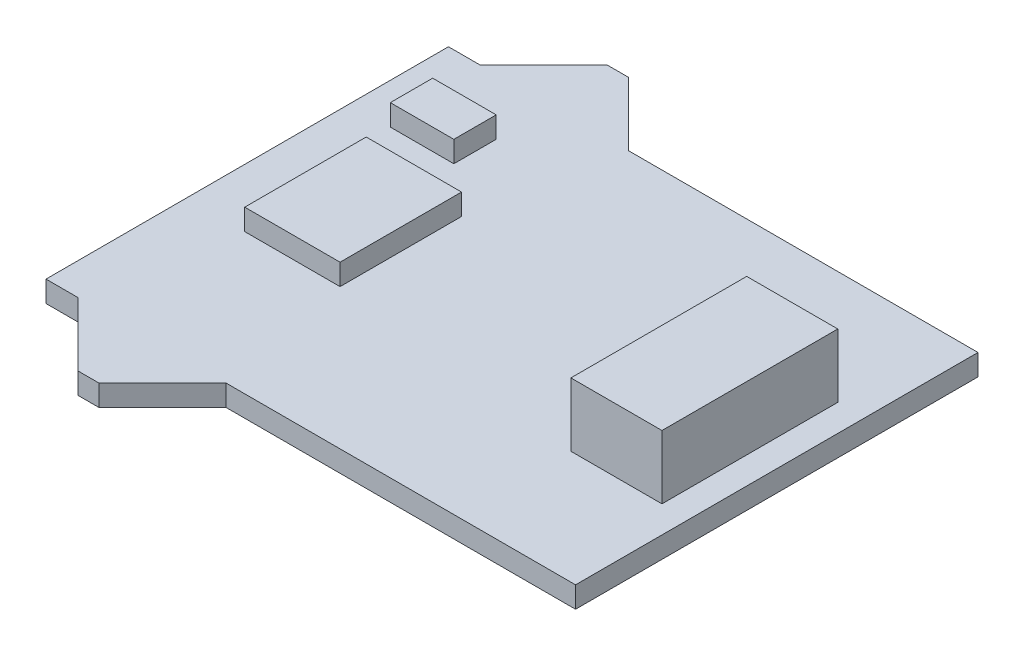
ISO-10303-21;
HEADER;
FILE_DESCRIPTION(('STEP AP214'),'2;1');
FILE_NAME('part.step','',(''),(''),'','','');
FILE_SCHEMA(('AUTOMOTIVE_DESIGN { 1 0 10303 214 1 1 1 1 }'));
ENDSEC;
DATA;
#1=APPLICATION_CONTEXT('core data for automotive mechanical design processes');
#2=APPLICATION_PROTOCOL_DEFINITION('international standard','automotive_design',2000,#1);
#3=PRODUCT_CONTEXT('',#1,'mechanical');
#4=PRODUCT('Part','Part','',(#3));
#5=PRODUCT_RELATED_PRODUCT_CATEGORY('part','',(#4));
#6=PRODUCT_DEFINITION_FORMATION('','',#4);
#7=PRODUCT_DEFINITION_CONTEXT('part definition',#1,'design');
#8=PRODUCT_DEFINITION('design','',#6,#7);
#9=PRODUCT_DEFINITION_SHAPE('','',#8);
#10=(LENGTH_UNIT() NAMED_UNIT(*) SI_UNIT(.MILLI.,.METRE.));
#11=(NAMED_UNIT(*) PLANE_ANGLE_UNIT() SI_UNIT($,.RADIAN.));
#12=(NAMED_UNIT(*) SI_UNIT($,.STERADIAN.) SOLID_ANGLE_UNIT());
#13=UNCERTAINTY_MEASURE_WITH_UNIT(LENGTH_MEASURE(1.E-05),#10,'distance_accuracy_value','');
#14=(GEOMETRIC_REPRESENTATION_CONTEXT(3) GLOBAL_UNCERTAINTY_ASSIGNED_CONTEXT((#13)) GLOBAL_UNIT_ASSIGNED_CONTEXT((#10,
#11,#12)) REPRESENTATION_CONTEXT('',''));
#15=CARTESIAN_POINT('',(0.,0.,0.));
#16=DIRECTION('',(0.,0.,1.));
#17=DIRECTION('',(1.,0.,0.));
#18=AXIS2_PLACEMENT_3D('',#15,#16,#17);
#19=CARTESIAN_POINT('',(0.,0.,0.));
#20=DIRECTION('',(0.,-1.,0.));
#21=DIRECTION('',(0.,0.,-1.));
#22=AXIS2_PLACEMENT_3D('',#19,#20,#21);
#23=PLANE('',#22);
#24=DIRECTION('',(0.,0.,-1.));
#25=VECTOR('',#24,1.);
#26=CARTESIAN_POINT('',(-0.0875000000000005,0.,-4.842));
#27=LINE('',#26,#25);
#28=CARTESIAN_POINT('',(-0.0875000000000005,0.,-4.842));
#29=VERTEX_POINT('',#28);
#30=CARTESIAN_POINT('',(-0.0875000000000008,0.,-6.842));
#31=VERTEX_POINT('',#30);
#32=EDGE_CURVE('E216',#29,#31,#27,.T.);
#33=ORIENTED_EDGE('',*,*,#32,.F.);
#34=DIRECTION('',(1.,0.,0.));
#35=VECTOR('',#34,1.);
#36=CARTESIAN_POINT('',(-3.0875,0.,-4.842));
#37=LINE('',#36,#35);
#38=CARTESIAN_POINT('',(-3.0875,0.,-4.842));
#39=VERTEX_POINT('',#38);
#40=EDGE_CURVE('E229',#39,#29,#37,.T.);
#41=ORIENTED_EDGE('',*,*,#40,.F.);
#42=DIRECTION('',(0.,0.,1.));
#43=VECTOR('',#42,1.);
#44=CARTESIAN_POINT('',(-3.0875,0.,-4.842));
#45=LINE('',#44,#43);
#46=CARTESIAN_POINT('',(-3.0875,0.,-6.842));
#47=VERTEX_POINT('',#46);
#48=EDGE_CURVE('E238',#47,#39,#45,.T.);
#49=ORIENTED_EDGE('',*,*,#48,.F.);
#50=DIRECTION('',(-1.,0.,0.));
#51=VECTOR('',#50,1.);
#52=CARTESIAN_POINT('',(-3.0875,0.,-6.842));
#53=LINE('',#52,#51);
#54=EDGE_CURVE('E219',#31,#47,#53,.T.);
#55=ORIENTED_EDGE('',*,*,#54,.F.);
#56=EDGE_LOOP('',(#33,#41,#49,#55));
#57=FACE_BOUND('',#56,.T.);
#58=DIRECTION('',(0.,0.,-1.));
#59=VECTOR('',#58,1.);
#60=CARTESIAN_POINT('',(20.000000132,0.,-9.50000005));
#61=LINE('',#60,#59);
#62=CARTESIAN_POINT('',(20.000000132,0.,9.50000005));
#63=VERTEX_POINT('',#62);
#64=CARTESIAN_POINT('',(20.000000132,0.,-9.50000005));
#65=VERTEX_POINT('',#64);
#66=EDGE_CURVE('E291',#63,#65,#61,.T.);
#67=ORIENTED_EDGE('',*,*,#66,.T.);
#68=DIRECTION('',(-1.,0.,0.));
#69=VECTOR('',#68,1.);
#70=CARTESIAN_POINT('',(3.499999985,0.,-9.50000005));
#71=LINE('',#70,#69);
#72=CARTESIAN_POINT('',(3.499999985,0.,-9.50000005));
#73=VERTEX_POINT('',#72);
#74=EDGE_CURVE('E287',#65,#73,#71,.T.);
#75=ORIENTED_EDGE('',*,*,#74,.T.);
#76=DIRECTION('',(-0.707106781186547,0.,-0.707106781186547));
#77=VECTOR('',#76,1.);
#78=CARTESIAN_POINT('',(0.499999888999999,0.,-12.500000146));
#79=LINE('',#78,#77);
#80=CARTESIAN_POINT('',(0.499999888999999,0.,-12.500000146));
#81=VERTEX_POINT('',#80);
#82=EDGE_CURVE('E325',#73,#81,#79,.T.);
#83=ORIENTED_EDGE('',*,*,#82,.T.);
#84=DIRECTION('',(-1.,0.,0.));
#85=VECTOR('',#84,1.);
#86=CARTESIAN_POINT('',(-0.499999888999999,0.,-12.500000146));
#87=LINE('',#86,#85);
#88=CARTESIAN_POINT('',(-0.499999888999999,0.,-12.500000146));
#89=VERTEX_POINT('',#88);
#90=EDGE_CURVE('E328',#81,#89,#87,.T.);
#91=ORIENTED_EDGE('',*,*,#90,.T.);
#92=DIRECTION('',(-0.707106781186547,0.,0.707106781186547));
#93=VECTOR('',#92,1.);
#94=CARTESIAN_POINT('',(-3.499999985,0.,-9.50000005));
#95=LINE('',#94,#93);
#96=CARTESIAN_POINT('',(-3.499999985,0.,-9.50000005));
#97=VERTEX_POINT('',#96);
#98=EDGE_CURVE('E331',#89,#97,#95,.T.);
#99=ORIENTED_EDGE('',*,*,#98,.T.);
#100=DIRECTION('',(-1.,0.,0.));
#101=VECTOR('',#100,1.);
#102=CARTESIAN_POINT('',(-4.999999906,0.,-9.50000005));
#103=LINE('',#102,#101);
#104=CARTESIAN_POINT('',(-4.999999906,0.,-9.50000005));
#105=VERTEX_POINT('',#104);
#106=EDGE_CURVE('E334',#97,#105,#103,.T.);
#107=ORIENTED_EDGE('',*,*,#106,.T.);
#108=DIRECTION('',(0.,0.,1.));
#109=VECTOR('',#108,1.);
#110=CARTESIAN_POINT('',(-4.999999906,0.,-9.50000005));
#111=LINE('',#110,#109);
#112=CARTESIAN_POINT('',(-4.999999906,0.,9.50000005));
#113=VERTEX_POINT('',#112);
#114=EDGE_CURVE('E337',#105,#113,#111,.T.);
#115=ORIENTED_EDGE('',*,*,#114,.T.);
#116=DIRECTION('',(1.,0.,0.));
#117=VECTOR('',#116,1.);
#118=CARTESIAN_POINT('',(-4.999999906,0.,9.50000005));
#119=LINE('',#118,#117);
#120=CARTESIAN_POINT('',(-3.499999985,0.,9.50000005));
#121=VERTEX_POINT('',#120);
#122=EDGE_CURVE('E340',#113,#121,#119,.T.);
#123=ORIENTED_EDGE('',*,*,#122,.T.);
#124=DIRECTION('',(0.707106781186547,0.,0.707106781186547));
#125=VECTOR('',#124,1.);
#126=CARTESIAN_POINT('',(-3.499999985,0.,9.50000005));
#127=LINE('',#126,#125);
#128=CARTESIAN_POINT('',(-0.499999888999999,0.,12.500000146));
#129=VERTEX_POINT('',#128);
#130=EDGE_CURVE('E343',#121,#129,#127,.T.);
#131=ORIENTED_EDGE('',*,*,#130,.T.);
#132=DIRECTION('',(1.,0.,0.));
#133=VECTOR('',#132,1.);
#134=CARTESIAN_POINT('',(-0.499999888999999,0.,12.500000146));
#135=LINE('',#134,#133);
#136=CARTESIAN_POINT('',(0.499999888999999,0.,12.500000146));
#137=VERTEX_POINT('',#136);
#138=EDGE_CURVE('E346',#129,#137,#135,.T.);
#139=ORIENTED_EDGE('',*,*,#138,.T.);
#140=DIRECTION('',(0.707106781186547,0.,-0.707106781186547));
#141=VECTOR('',#140,1.);
#142=CARTESIAN_POINT('',(0.499999888999999,0.,12.500000146));
#143=LINE('',#142,#141);
#144=CARTESIAN_POINT('',(3.499999985,0.,9.50000005));
#145=VERTEX_POINT('',#144);
#146=EDGE_CURVE('E349',#137,#145,#143,.T.);
#147=ORIENTED_EDGE('',*,*,#146,.T.);
#148=DIRECTION('',(1.,0.,0.));
#149=VECTOR('',#148,1.);
#150=CARTESIAN_POINT('',(4.999999906,0.,9.50000005));
#151=LINE('',#150,#149);
#152=EDGE_CURVE('E352',#145,#63,#151,.T.);
#153=ORIENTED_EDGE('',*,*,#152,.T.);
#154=EDGE_LOOP('',(#67,#75,#83,#91,#99,#107,#115,#123,#131,#139,#147,#153));
#155=FACE_BOUND('',#154,.T.);
#156=DIRECTION('',(0.,0.,-1.));
#157=VECTOR('',#156,1.);
#158=CARTESIAN_POINT('',(2.249999945,0.,2.86760421207147));
#159=LINE('',#158,#157);
#160=CARTESIAN_POINT('',(2.249999945,0.,2.86760421207147));
#161=VERTEX_POINT('',#160);
#162=CARTESIAN_POINT('',(2.249999945,0.,-2.86760421207147));
#163=VERTEX_POINT('',#162);
#164=EDGE_CURVE('E254',#161,#163,#159,.T.);
#165=ORIENTED_EDGE('',*,*,#164,.F.);
#166=DIRECTION('',(1.,0.,0.));
#167=VECTOR('',#166,1.);
#168=CARTESIAN_POINT('',(-2.249999945,0.,2.86760421207147));
#169=LINE('',#168,#167);
#170=CARTESIAN_POINT('',(-2.249999945,0.,2.86760421207147));
#171=VERTEX_POINT('',#170);
#172=EDGE_CURVE('E259',#171,#161,#169,.T.);
#173=ORIENTED_EDGE('',*,*,#172,.F.);
#174=DIRECTION('',(0.,0.,1.));
#175=VECTOR('',#174,1.);
#176=CARTESIAN_POINT('',(-2.249999945,0.,2.86760421207147));
#177=LINE('',#176,#175);
#178=CARTESIAN_POINT('',(-2.249999945,0.,-2.86760421207147));
#179=VERTEX_POINT('',#178);
#180=EDGE_CURVE('E271',#179,#171,#177,.T.);
#181=ORIENTED_EDGE('',*,*,#180,.F.);
#182=DIRECTION('',(-1.,0.,0.));
#183=VECTOR('',#182,1.);
#184=CARTESIAN_POINT('',(-2.249999945,0.,-2.86760421207147));
#185=LINE('',#184,#183);
#186=EDGE_CURVE('E268',#163,#179,#185,.T.);
#187=ORIENTED_EDGE('',*,*,#186,.F.);
#188=EDGE_LOOP('',(#165,#173,#181,#187));
#189=FACE_BOUND('',#188,.T.);
#190=DIRECTION('',(1.,0.,0.));
#191=VECTOR('',#190,1.);
#192=CARTESIAN_POINT('',(14.430000096,0.,4.149999955));
#193=LINE('',#192,#191);
#194=CARTESIAN_POINT('',(14.430000096,0.,4.149999955));
#195=VERTEX_POINT('',#194);
#196=CARTESIAN_POINT('',(18.730000132,0.,4.149999955));
#197=VERTEX_POINT('',#196);
#198=EDGE_CURVE('E215',#195,#197,#193,.T.);
#199=ORIENTED_EDGE('',*,*,#198,.F.);
#200=DIRECTION('',(0.,0.,1.));
#201=VECTOR('',#200,1.);
#202=CARTESIAN_POINT('',(14.430000096,0.,4.149999955));
#203=LINE('',#202,#201);
#204=CARTESIAN_POINT('',(14.430000096,0.,-4.149999955));
#205=VERTEX_POINT('',#204);
#206=EDGE_CURVE('E212',#205,#195,#203,.T.);
#207=ORIENTED_EDGE('',*,*,#206,.F.);
#208=DIRECTION('',(-1.,0.,0.));
#209=VECTOR('',#208,1.);
#210=CARTESIAN_POINT('',(14.430000096,0.,-4.149999955));
#211=LINE('',#210,#209);
#212=CARTESIAN_POINT('',(18.730000132,0.,-4.149999955));
#213=VERTEX_POINT('',#212);
#214=EDGE_CURVE('E54',#213,#205,#211,.T.);
#215=ORIENTED_EDGE('',*,*,#214,.F.);
#216=DIRECTION('',(0.,0.,-1.));
#217=VECTOR('',#216,1.);
#218=CARTESIAN_POINT('',(18.730000132,0.,4.149999955));
#219=LINE('',#218,#217);
#220=EDGE_CURVE('E49',#197,#213,#219,.T.);
#221=ORIENTED_EDGE('',*,*,#220,.F.);
#222=EDGE_LOOP('',(#199,#207,#215,#221));
#223=FACE_BOUND('',#222,.T.);
#224=ADVANCED_FACE('F32',(#57,#155,#189,#223),#23,.F.);
#225=CARTESIAN_POINT('',(20.000000132,-1.000000032,-9.50000005));
#226=DIRECTION('',(1.,0.,0.));
#227=DIRECTION('',(0.,0.,-1.));
#228=AXIS2_PLACEMENT_3D('',#225,#226,#227);
#229=PLANE('',#228);
#230=ORIENTED_EDGE('',*,*,#66,.F.);
#231=DIRECTION('',(0.,1.,0.));
#232=VECTOR('',#231,1.);
#233=CARTESIAN_POINT('',(20.000000132,-1.000000032,9.50000005));
#234=LINE('',#233,#232);
#235=CARTESIAN_POINT('',(20.000000132,-1.000000032,9.50000005));
#236=VERTEX_POINT('',#235);
#237=EDGE_CURVE('E41',#236,#63,#234,.T.);
#238=ORIENTED_EDGE('',*,*,#237,.F.);
#239=DIRECTION('',(0.,0.,-1.));
#240=VECTOR('',#239,1.);
#241=CARTESIAN_POINT('',(20.000000132,-1.000000032,-9.50000005));
#242=LINE('',#241,#240);
#243=CARTESIAN_POINT('',(20.000000132,-1.000000032,-9.50000005));
#244=VERTEX_POINT('',#243);
#245=EDGE_CURVE('E320',#236,#244,#242,.T.);
#246=ORIENTED_EDGE('',*,*,#245,.T.);
#247=DIRECTION('',(0.,1.,0.));
#248=VECTOR('',#247,1.);
#249=CARTESIAN_POINT('',(20.000000132,-1.000000032,-9.50000005));
#250=LINE('',#249,#248);
#251=EDGE_CURVE('E11',#244,#65,#250,.T.);
#252=ORIENTED_EDGE('',*,*,#251,.T.);
#253=EDGE_LOOP('',(#230,#238,#246,#252));
#254=FACE_BOUND('',#253,.T.);
#255=ADVANCED_FACE('F388',(#254),#229,.T.);
#256=CARTESIAN_POINT('',(4.999999906,-1.000000032,9.50000005));
#257=DIRECTION('',(0.,0.,1.));
#258=DIRECTION('',(1.,0.,0.));
#259=AXIS2_PLACEMENT_3D('',#256,#257,#258);
#260=PLANE('',#259);
#261=ORIENTED_EDGE('',*,*,#152,.F.);
#262=DIRECTION('',(0.,1.,0.));
#263=VECTOR('',#262,1.);
#264=CARTESIAN_POINT('',(3.499999985,-1.000000032,9.50000005));
#265=LINE('',#264,#263);
#266=CARTESIAN_POINT('',(3.499999985,-1.000000032,9.50000005));
#267=VERTEX_POINT('',#266);
#268=EDGE_CURVE('E358',#267,#145,#265,.T.);
#269=ORIENTED_EDGE('',*,*,#268,.F.);
#270=DIRECTION('',(1.,0.,0.));
#271=VECTOR('',#270,1.);
#272=CARTESIAN_POINT('',(3.499999985,-1.000000032,9.50000005));
#273=LINE('',#272,#271);
#274=EDGE_CURVE('E318',#267,#236,#273,.T.);
#275=ORIENTED_EDGE('',*,*,#274,.T.);
#276=ORIENTED_EDGE('',*,*,#237,.T.);
#277=EDGE_LOOP('',(#261,#269,#275,#276));
#278=FACE_BOUND('',#277,.T.);
#279=ADVANCED_FACE('F425',(#278),#260,.T.);
#280=CARTESIAN_POINT('',(0.499999888999999,-1.000000032,12.500000146));
#281=DIRECTION('',(0.707106781186547,0.,0.707106781186548));
#282=DIRECTION('',(0.707106781186548,0.,-0.707106781186547));
#283=AXIS2_PLACEMENT_3D('',#280,#281,#282);
#284=PLANE('',#283);
#285=ORIENTED_EDGE('',*,*,#146,.F.);
#286=DIRECTION('',(0.,1.,0.));
#287=VECTOR('',#286,1.);
#288=CARTESIAN_POINT('',(0.499999888999999,-1.000000032,12.500000146));
#289=LINE('',#288,#287);
#290=CARTESIAN_POINT('',(0.499999888999999,-1.000000032,12.500000146));
#291=VERTEX_POINT('',#290);
#292=EDGE_CURVE('E361',#291,#137,#289,.T.);
#293=ORIENTED_EDGE('',*,*,#292,.F.);
#294=DIRECTION('',(0.707106781186547,0.,-0.707106781186547));
#295=VECTOR('',#294,1.);
#296=CARTESIAN_POINT('',(0.499999888999999,-1.000000032,12.500000146));
#297=LINE('',#296,#295);
#298=EDGE_CURVE('E315',#291,#267,#297,.T.);
#299=ORIENTED_EDGE('',*,*,#298,.T.);
#300=ORIENTED_EDGE('',*,*,#268,.T.);
#301=EDGE_LOOP('',(#285,#293,#299,#300));
#302=FACE_BOUND('',#301,.T.);
#303=ADVANCED_FACE('F422',(#302),#284,.T.);
#304=CARTESIAN_POINT('',(-0.499999888999999,-1.000000032,12.500000146));
#305=DIRECTION('',(0.,0.,1.));
#306=DIRECTION('',(1.,0.,0.));
#307=AXIS2_PLACEMENT_3D('',#304,#305,#306);
#308=PLANE('',#307);
#309=ORIENTED_EDGE('',*,*,#138,.F.);
#310=DIRECTION('',(0.,1.,0.));
#311=VECTOR('',#310,1.);
#312=CARTESIAN_POINT('',(-0.499999888999999,-1.000000032,12.500000146));
#313=LINE('',#312,#311);
#314=CARTESIAN_POINT('',(-0.499999888999999,-1.000000032,12.500000146));
#315=VERTEX_POINT('',#314);
#316=EDGE_CURVE('E363',#315,#129,#313,.T.);
#317=ORIENTED_EDGE('',*,*,#316,.F.);
#318=DIRECTION('',(1.,0.,0.));
#319=VECTOR('',#318,1.);
#320=CARTESIAN_POINT('',(-0.499999888999999,-1.000000032,12.500000146));
#321=LINE('',#320,#319);
#322=EDGE_CURVE('E312',#315,#291,#321,.T.);
#323=ORIENTED_EDGE('',*,*,#322,.T.);
#324=ORIENTED_EDGE('',*,*,#292,.T.);
#325=EDGE_LOOP('',(#309,#317,#323,#324));
#326=FACE_BOUND('',#325,.T.);
#327=ADVANCED_FACE('F419',(#326),#308,.T.);
#328=CARTESIAN_POINT('',(-3.499999985,-1.000000032,9.50000005));
#329=DIRECTION('',(-0.707106781186547,0.,0.707106781186548));
#330=DIRECTION('',(0.707106781186548,0.,0.707106781186547));
#331=AXIS2_PLACEMENT_3D('',#328,#329,#330);
#332=PLANE('',#331);
#333=ORIENTED_EDGE('',*,*,#130,.F.);
#334=DIRECTION('',(0.,1.,0.));
#335=VECTOR('',#334,1.);
#336=CARTESIAN_POINT('',(-3.499999985,-1.000000032,9.50000005));
#337=LINE('',#336,#335);
#338=CARTESIAN_POINT('',(-3.499999985,-1.000000032,9.50000005));
#339=VERTEX_POINT('',#338);
#340=EDGE_CURVE('E365',#339,#121,#337,.T.);
#341=ORIENTED_EDGE('',*,*,#340,.F.);
#342=DIRECTION('',(0.707106781186547,0.,0.707106781186547));
#343=VECTOR('',#342,1.);
#344=CARTESIAN_POINT('',(-3.499999985,-1.000000032,9.50000005));
#345=LINE('',#344,#343);
#346=EDGE_CURVE('E309',#339,#315,#345,.T.);
#347=ORIENTED_EDGE('',*,*,#346,.T.);
#348=ORIENTED_EDGE('',*,*,#316,.T.);
#349=EDGE_LOOP('',(#333,#341,#347,#348));
#350=FACE_BOUND('',#349,.T.);
#351=ADVANCED_FACE('F415',(#350),#332,.T.);
#352=CARTESIAN_POINT('',(-4.999999906,-1.000000032,9.50000005));
#353=DIRECTION('',(0.,0.,1.));
#354=DIRECTION('',(1.,0.,0.));
#355=AXIS2_PLACEMENT_3D('',#352,#353,#354);
#356=PLANE('',#355);
#357=ORIENTED_EDGE('',*,*,#122,.F.);
#358=DIRECTION('',(0.,1.,0.));
#359=VECTOR('',#358,1.);
#360=CARTESIAN_POINT('',(-4.999999906,-1.000000032,9.50000005));
#361=LINE('',#360,#359);
#362=CARTESIAN_POINT('',(-4.999999906,-1.000000032,9.50000005));
#363=VERTEX_POINT('',#362);
#364=EDGE_CURVE('E367',#363,#113,#361,.T.);
#365=ORIENTED_EDGE('',*,*,#364,.F.);
#366=DIRECTION('',(1.,0.,0.));
#367=VECTOR('',#366,1.);
#368=CARTESIAN_POINT('',(-4.999999906,-1.000000032,9.50000005));
#369=LINE('',#368,#367);
#370=EDGE_CURVE('E306',#363,#339,#369,.T.);
#371=ORIENTED_EDGE('',*,*,#370,.T.);
#372=ORIENTED_EDGE('',*,*,#340,.T.);
#373=EDGE_LOOP('',(#357,#365,#371,#372));
#374=FACE_BOUND('',#373,.T.);
#375=ADVANCED_FACE('F411',(#374),#356,.T.);
#376=CARTESIAN_POINT('',(-4.999999906,-1.000000032,-9.50000005));
#377=DIRECTION('',(-1.,0.,0.));
#378=DIRECTION('',(0.,0.,1.));
#379=AXIS2_PLACEMENT_3D('',#376,#377,#378);
#380=PLANE('',#379);
#381=ORIENTED_EDGE('',*,*,#114,.F.);
#382=DIRECTION('',(0.,1.,0.));
#383=VECTOR('',#382,1.);
#384=CARTESIAN_POINT('',(-4.999999906,-1.000000032,-9.50000005));
#385=LINE('',#384,#383);
#386=CARTESIAN_POINT('',(-4.999999906,-1.000000032,-9.50000005));
#387=VERTEX_POINT('',#386);
#388=EDGE_CURVE('E369',#387,#105,#385,.T.);
#389=ORIENTED_EDGE('',*,*,#388,.F.);
#390=DIRECTION('',(0.,0.,1.));
#391=VECTOR('',#390,1.);
#392=CARTESIAN_POINT('',(-4.999999906,-1.000000032,-9.50000005));
#393=LINE('',#392,#391);
#394=EDGE_CURVE('E303',#387,#363,#393,.T.);
#395=ORIENTED_EDGE('',*,*,#394,.T.);
#396=ORIENTED_EDGE('',*,*,#364,.T.);
#397=EDGE_LOOP('',(#381,#389,#395,#396));
#398=FACE_BOUND('',#397,.T.);
#399=ADVANCED_FACE('F407',(#398),#380,.T.);
#400=CARTESIAN_POINT('',(-4.999999906,-1.000000032,-9.50000005));
#401=DIRECTION('',(0.,0.,-1.));
#402=DIRECTION('',(-1.,0.,0.));
#403=AXIS2_PLACEMENT_3D('',#400,#401,#402);
#404=PLANE('',#403);
#405=ORIENTED_EDGE('',*,*,#106,.F.);
#406=DIRECTION('',(0.,1.,0.));
#407=VECTOR('',#406,1.);
#408=CARTESIAN_POINT('',(-3.499999985,-1.000000032,-9.50000005));
#409=LINE('',#408,#407);
#410=CARTESIAN_POINT('',(-3.499999985,-1.000000032,-9.50000005));
#411=VERTEX_POINT('',#410);
#412=EDGE_CURVE('E371',#411,#97,#409,.T.);
#413=ORIENTED_EDGE('',*,*,#412,.F.);
#414=DIRECTION('',(-1.,0.,0.));
#415=VECTOR('',#414,1.);
#416=CARTESIAN_POINT('',(-4.999999906,-1.000000032,-9.50000005));
#417=LINE('',#416,#415);
#418=EDGE_CURVE('E300',#411,#387,#417,.T.);
#419=ORIENTED_EDGE('',*,*,#418,.T.);
#420=ORIENTED_EDGE('',*,*,#388,.T.);
#421=EDGE_LOOP('',(#405,#413,#419,#420));
#422=FACE_BOUND('',#421,.T.);
#423=ADVANCED_FACE('F403',(#422),#404,.T.);
#424=CARTESIAN_POINT('',(-3.499999985,-1.000000032,-9.50000005));
#425=DIRECTION('',(-0.707106781186547,0.,-0.707106781186548));
#426=DIRECTION('',(-0.707106781186548,0.,0.707106781186547));
#427=AXIS2_PLACEMENT_3D('',#424,#425,#426);
#428=PLANE('',#427);
#429=ORIENTED_EDGE('',*,*,#98,.F.);
#430=DIRECTION('',(0.,1.,0.));
#431=VECTOR('',#430,1.);
#432=CARTESIAN_POINT('',(-0.499999888999999,-1.000000032,-12.500000146));
#433=LINE('',#432,#431);
#434=CARTESIAN_POINT('',(-0.499999888999999,-1.000000032,-12.500000146));
#435=VERTEX_POINT('',#434);
#436=EDGE_CURVE('E373',#435,#89,#433,.T.);
#437=ORIENTED_EDGE('',*,*,#436,.F.);
#438=DIRECTION('',(-0.707106781186547,0.,0.707106781186547));
#439=VECTOR('',#438,1.);
#440=CARTESIAN_POINT('',(-3.499999985,-1.000000032,-9.50000005));
#441=LINE('',#440,#439);
#442=EDGE_CURVE('E297',#435,#411,#441,.T.);
#443=ORIENTED_EDGE('',*,*,#442,.T.);
#444=ORIENTED_EDGE('',*,*,#412,.T.);
#445=EDGE_LOOP('',(#429,#437,#443,#444));
#446=FACE_BOUND('',#445,.T.);
#447=ADVANCED_FACE('F401',(#446),#428,.T.);
#448=CARTESIAN_POINT('',(-0.499999888999999,-1.000000032,-12.500000146));
#449=DIRECTION('',(0.,0.,-1.));
#450=DIRECTION('',(-1.,0.,0.));
#451=AXIS2_PLACEMENT_3D('',#448,#449,#450);
#452=PLANE('',#451);
#453=ORIENTED_EDGE('',*,*,#90,.F.);
#454=DIRECTION('',(0.,1.,0.));
#455=VECTOR('',#454,1.);
#456=CARTESIAN_POINT('',(0.499999888999999,-1.000000032,-12.500000146));
#457=LINE('',#456,#455);
#458=CARTESIAN_POINT('',(0.499999888999999,-1.000000032,-12.500000146));
#459=VERTEX_POINT('',#458);
#460=EDGE_CURVE('E374',#459,#81,#457,.T.);
#461=ORIENTED_EDGE('',*,*,#460,.F.);
#462=DIRECTION('',(-1.,0.,0.));
#463=VECTOR('',#462,1.);
#464=CARTESIAN_POINT('',(-0.499999888999999,-1.000000032,-12.500000146));
#465=LINE('',#464,#463);
#466=EDGE_CURVE('E294',#459,#435,#465,.T.);
#467=ORIENTED_EDGE('',*,*,#466,.T.);
#468=ORIENTED_EDGE('',*,*,#436,.T.);
#469=EDGE_LOOP('',(#453,#461,#467,#468));
#470=FACE_BOUND('',#469,.T.);
#471=ADVANCED_FACE('F397',(#470),#452,.T.);
#472=CARTESIAN_POINT('',(0.499999888999999,-1.000000032,-12.500000146));
#473=DIRECTION('',(0.707106781186547,0.,-0.707106781186548));
#474=DIRECTION('',(-0.707106781186548,0.,-0.707106781186547));
#475=AXIS2_PLACEMENT_3D('',#472,#473,#474);
#476=PLANE('',#475);
#477=ORIENTED_EDGE('',*,*,#82,.F.);
#478=DIRECTION('',(0.,1.,0.));
#479=VECTOR('',#478,1.);
#480=CARTESIAN_POINT('',(3.499999985,-1.000000032,-9.50000005));
#481=LINE('',#480,#479);
#482=CARTESIAN_POINT('',(3.499999985,-1.000000032,-9.50000005));
#483=VERTEX_POINT('',#482);
#484=EDGE_CURVE('E36',#483,#73,#481,.T.);
#485=ORIENTED_EDGE('',*,*,#484,.F.);
#486=DIRECTION('',(-0.707106781186547,0.,-0.707106781186547));
#487=VECTOR('',#486,1.);
#488=CARTESIAN_POINT('',(0.499999888999999,-1.000000032,-12.500000146));
#489=LINE('',#488,#487);
#490=EDGE_CURVE('E290',#483,#459,#489,.T.);
#491=ORIENTED_EDGE('',*,*,#490,.T.);
#492=ORIENTED_EDGE('',*,*,#460,.T.);
#493=EDGE_LOOP('',(#477,#485,#491,#492));
#494=FACE_BOUND('',#493,.T.);
#495=ADVANCED_FACE('F382',(#494),#476,.T.);
#496=CARTESIAN_POINT('',(3.499999985,-1.000000032,-9.50000005));
#497=DIRECTION('',(0.,0.,-1.));
#498=DIRECTION('',(-1.,0.,0.));
#499=AXIS2_PLACEMENT_3D('',#496,#497,#498);
#500=PLANE('',#499);
#501=ORIENTED_EDGE('',*,*,#74,.F.);
#502=ORIENTED_EDGE('',*,*,#251,.F.);
#503=DIRECTION('',(-1.,0.,0.));
#504=VECTOR('',#503,1.);
#505=CARTESIAN_POINT('',(4.999999906,-1.000000032,-9.50000005));
#506=LINE('',#505,#504);
#507=EDGE_CURVE('E288',#244,#483,#506,.T.);
#508=ORIENTED_EDGE('',*,*,#507,.T.);
#509=ORIENTED_EDGE('',*,*,#484,.T.);
#510=EDGE_LOOP('',(#501,#502,#508,#509));
#511=FACE_BOUND('',#510,.T.);
#512=ADVANCED_FACE('F34',(#511),#500,.T.);
#513=CARTESIAN_POINT('',(0.,-1.000000032,0.));
#514=DIRECTION('',(0.,-1.,0.));
#515=DIRECTION('',(0.,0.,-1.));
#516=AXIS2_PLACEMENT_3D('',#513,#514,#515);
#517=PLANE('',#516);
#518=ORIENTED_EDGE('',*,*,#507,.F.);
#519=ORIENTED_EDGE('',*,*,#245,.F.);
#520=ORIENTED_EDGE('',*,*,#274,.F.);
#521=ORIENTED_EDGE('',*,*,#298,.F.);
#522=ORIENTED_EDGE('',*,*,#322,.F.);
#523=ORIENTED_EDGE('',*,*,#346,.F.);
#524=ORIENTED_EDGE('',*,*,#370,.F.);
#525=ORIENTED_EDGE('',*,*,#394,.F.);
#526=ORIENTED_EDGE('',*,*,#418,.F.);
#527=ORIENTED_EDGE('',*,*,#442,.F.);
#528=ORIENTED_EDGE('',*,*,#466,.F.);
#529=ORIENTED_EDGE('',*,*,#490,.F.);
#530=EDGE_LOOP('',(#518,#519,#520,#521,#522,#523,#524,#525,#526,#527,#528,#529));
#531=FACE_BOUND('',#530,.T.);
#532=ADVANCED_FACE('F391',(#531),#517,.T.);
#533=CARTESIAN_POINT('',(2.249999945,1.,2.86760421207147));
#534=DIRECTION('',(-1.,0.,0.));
#535=DIRECTION('',(0.,0.,1.));
#536=AXIS2_PLACEMENT_3D('',#533,#534,#535);
#537=PLANE('',#536);
#538=ORIENTED_EDGE('',*,*,#164,.T.);
#539=DIRECTION('',(0.,-1.,0.));
#540=VECTOR('',#539,1.);
#541=CARTESIAN_POINT('',(2.249999945,1.,-2.86760421207147));
#542=LINE('',#541,#540);
#543=CARTESIAN_POINT('',(2.249999945,1.,-2.86760421207147));
#544=VERTEX_POINT('',#543);
#545=EDGE_CURVE('E284',#544,#163,#542,.T.);
#546=ORIENTED_EDGE('',*,*,#545,.F.);
#547=DIRECTION('',(0.,0.,-1.));
#548=VECTOR('',#547,1.);
#549=CARTESIAN_POINT('',(2.249999945,1.,2.86760421207147));
#550=LINE('',#549,#548);
#551=CARTESIAN_POINT('',(2.249999945,1.,2.86760421207147));
#552=VERTEX_POINT('',#551);
#553=EDGE_CURVE('E255',#552,#544,#550,.T.);
#554=ORIENTED_EDGE('',*,*,#553,.F.);
#555=DIRECTION('',(0.,-1.,0.));
#556=VECTOR('',#555,1.);
#557=CARTESIAN_POINT('',(2.249999945,1.,2.86760421207147));
#558=LINE('',#557,#556);
#559=EDGE_CURVE('E265',#552,#161,#558,.T.);
#560=ORIENTED_EDGE('',*,*,#559,.T.);
#561=EDGE_LOOP('',(#538,#546,#554,#560));
#562=FACE_BOUND('',#561,.T.);
#563=ADVANCED_FACE('F442',(#562),#537,.F.);
#564=CARTESIAN_POINT('',(-2.249999945,1.,-2.86760421207147));
#565=DIRECTION('',(0.,0.,1.));
#566=DIRECTION('',(1.,0.,0.));
#567=AXIS2_PLACEMENT_3D('',#564,#565,#566);
#568=PLANE('',#567);
#569=ORIENTED_EDGE('',*,*,#186,.T.);
#570=DIRECTION('',(0.,-1.,0.));
#571=VECTOR('',#570,1.);
#572=CARTESIAN_POINT('',(-2.249999945,1.,-2.86760421207147));
#573=LINE('',#572,#571);
#574=CARTESIAN_POINT('',(-2.249999945,1.,-2.86760421207147));
#575=VERTEX_POINT('',#574);
#576=EDGE_CURVE('E281',#575,#179,#573,.T.);
#577=ORIENTED_EDGE('',*,*,#576,.F.);
#578=DIRECTION('',(-1.,0.,0.));
#579=VECTOR('',#578,1.);
#580=CARTESIAN_POINT('',(-2.249999945,1.,-2.86760421207147));
#581=LINE('',#580,#579);
#582=EDGE_CURVE('E258',#544,#575,#581,.T.);
#583=ORIENTED_EDGE('',*,*,#582,.F.);
#584=ORIENTED_EDGE('',*,*,#545,.T.);
#585=EDGE_LOOP('',(#569,#577,#583,#584));
#586=FACE_BOUND('',#585,.T.);
#587=ADVANCED_FACE('F445',(#586),#568,.F.);
#588=CARTESIAN_POINT('',(-2.249999945,1.,2.86760421207147));
#589=DIRECTION('',(1.,0.,0.));
#590=DIRECTION('',(0.,0.,-1.));
#591=AXIS2_PLACEMENT_3D('',#588,#589,#590);
#592=PLANE('',#591);
#593=ORIENTED_EDGE('',*,*,#180,.T.);
#594=DIRECTION('',(0.,-1.,0.));
#595=VECTOR('',#594,1.);
#596=CARTESIAN_POINT('',(-2.249999945,1.,2.86760421207147));
#597=LINE('',#596,#595);
#598=CARTESIAN_POINT('',(-2.249999945,1.,2.86760421207147));
#599=VERTEX_POINT('',#598);
#600=EDGE_CURVE('E278',#599,#171,#597,.T.);
#601=ORIENTED_EDGE('',*,*,#600,.F.);
#602=DIRECTION('',(0.,0.,1.));
#603=VECTOR('',#602,1.);
#604=CARTESIAN_POINT('',(-2.249999945,1.,2.86760421207147));
#605=LINE('',#604,#603);
#606=EDGE_CURVE('E261',#575,#599,#605,.T.);
#607=ORIENTED_EDGE('',*,*,#606,.F.);
#608=ORIENTED_EDGE('',*,*,#576,.T.);
#609=EDGE_LOOP('',(#593,#601,#607,#608));
#610=FACE_BOUND('',#609,.T.);
#611=ADVANCED_FACE('F449',(#610),#592,.F.);
#612=CARTESIAN_POINT('',(-2.249999945,1.,2.86760421207147));
#613=DIRECTION('',(0.,0.,-1.));
#614=DIRECTION('',(-1.,0.,0.));
#615=AXIS2_PLACEMENT_3D('',#612,#613,#614);
#616=PLANE('',#615);
#617=ORIENTED_EDGE('',*,*,#172,.T.);
#618=ORIENTED_EDGE('',*,*,#559,.F.);
#619=DIRECTION('',(1.,0.,0.));
#620=VECTOR('',#619,1.);
#621=CARTESIAN_POINT('',(-2.249999945,1.,2.86760421207147));
#622=LINE('',#621,#620);
#623=EDGE_CURVE('E263',#599,#552,#622,.T.);
#624=ORIENTED_EDGE('',*,*,#623,.F.);
#625=ORIENTED_EDGE('',*,*,#600,.T.);
#626=EDGE_LOOP('',(#617,#618,#624,#625));
#627=FACE_BOUND('',#626,.T.);
#628=ADVANCED_FACE('F453',(#627),#616,.F.);
#629=CARTESIAN_POINT('',(0.,1.,0.));
#630=DIRECTION('',(0.,-1.,0.));
#631=DIRECTION('',(0.,0.,-1.));
#632=AXIS2_PLACEMENT_3D('',#629,#630,#631);
#633=PLANE('',#632);
#634=ORIENTED_EDGE('',*,*,#553,.T.);
#635=ORIENTED_EDGE('',*,*,#582,.T.);
#636=ORIENTED_EDGE('',*,*,#606,.T.);
#637=ORIENTED_EDGE('',*,*,#623,.T.);
#638=EDGE_LOOP('',(#634,#635,#636,#637));
#639=FACE_BOUND('',#638,.T.);
#640=ADVANCED_FACE('F457',(#639),#633,.F.);
#641=CARTESIAN_POINT('',(-0.0875000000000005,1.,-4.842));
#642=DIRECTION('',(-1.,0.,0.));
#643=DIRECTION('',(0.,0.,1.));
#644=AXIS2_PLACEMENT_3D('',#641,#642,#643);
#645=PLANE('',#644);
#646=ORIENTED_EDGE('',*,*,#32,.T.);
#647=DIRECTION('',(0.,-1.,0.));
#648=VECTOR('',#647,1.);
#649=CARTESIAN_POINT('',(-0.0875000000000008,1.,-6.842));
#650=LINE('',#649,#648);
#651=CARTESIAN_POINT('',(-0.0875000000000008,1.,-6.842));
#652=VERTEX_POINT('',#651);
#653=EDGE_CURVE('E251',#652,#31,#650,.T.);
#654=ORIENTED_EDGE('',*,*,#653,.F.);
#655=DIRECTION('',(0.,0.,-1.));
#656=VECTOR('',#655,1.);
#657=CARTESIAN_POINT('',(-0.0875000000000005,1.,-4.842));
#658=LINE('',#657,#656);
#659=CARTESIAN_POINT('',(-0.0875000000000005,1.,-4.842));
#660=VERTEX_POINT('',#659);
#661=EDGE_CURVE('E225',#660,#652,#658,.T.);
#662=ORIENTED_EDGE('',*,*,#661,.F.);
#663=DIRECTION('',(0.,-1.,0.));
#664=VECTOR('',#663,1.);
#665=CARTESIAN_POINT('',(-0.0875000000000005,1.,-4.842));
#666=LINE('',#665,#664);
#667=EDGE_CURVE('E234',#660,#29,#666,.T.);
#668=ORIENTED_EDGE('',*,*,#667,.T.);
#669=EDGE_LOOP('',(#646,#654,#662,#668));
#670=FACE_BOUND('',#669,.T.);
#671=ADVANCED_FACE('F461',(#670),#645,.F.);
#672=CARTESIAN_POINT('',(-3.0875,1.,-6.842));
#673=DIRECTION('',(0.,0.,1.));
#674=DIRECTION('',(1.,0.,0.));
#675=AXIS2_PLACEMENT_3D('',#672,#673,#674);
#676=PLANE('',#675);
#677=ORIENTED_EDGE('',*,*,#54,.T.);
#678=DIRECTION('',(0.,-1.,0.));
#679=VECTOR('',#678,1.);
#680=CARTESIAN_POINT('',(-3.0875,1.,-6.842));
#681=LINE('',#680,#679);
#682=CARTESIAN_POINT('',(-3.0875,1.,-6.842));
#683=VERTEX_POINT('',#682);
#684=EDGE_CURVE('E248',#683,#47,#681,.T.);
#685=ORIENTED_EDGE('',*,*,#684,.F.);
#686=DIRECTION('',(-1.,0.,0.));
#687=VECTOR('',#686,1.);
#688=CARTESIAN_POINT('',(-3.0875,1.,-6.842));
#689=LINE('',#688,#687);
#690=EDGE_CURVE('E228',#652,#683,#689,.T.);
#691=ORIENTED_EDGE('',*,*,#690,.F.);
#692=ORIENTED_EDGE('',*,*,#653,.T.);
#693=EDGE_LOOP('',(#677,#685,#691,#692));
#694=FACE_BOUND('',#693,.T.);
#695=ADVANCED_FACE('F465',(#694),#676,.F.);
#696=CARTESIAN_POINT('',(-3.0875,1.,-4.842));
#697=DIRECTION('',(1.,0.,0.));
#698=DIRECTION('',(0.,0.,-1.));
#699=AXIS2_PLACEMENT_3D('',#696,#697,#698);
#700=PLANE('',#699);
#701=ORIENTED_EDGE('',*,*,#48,.T.);
#702=DIRECTION('',(0.,-1.,0.));
#703=VECTOR('',#702,1.);
#704=CARTESIAN_POINT('',(-3.0875,1.,-4.842));
#705=LINE('',#704,#703);
#706=CARTESIAN_POINT('',(-3.0875,1.,-4.842));
#707=VERTEX_POINT('',#706);
#708=EDGE_CURVE('E245',#707,#39,#705,.T.);
#709=ORIENTED_EDGE('',*,*,#708,.F.);
#710=DIRECTION('',(0.,0.,1.));
#711=VECTOR('',#710,1.);
#712=CARTESIAN_POINT('',(-3.0875,1.,-4.842));
#713=LINE('',#712,#711);
#714=EDGE_CURVE('E231',#683,#707,#713,.T.);
#715=ORIENTED_EDGE('',*,*,#714,.F.);
#716=ORIENTED_EDGE('',*,*,#684,.T.);
#717=EDGE_LOOP('',(#701,#709,#715,#716));
#718=FACE_BOUND('',#717,.T.);
#719=ADVANCED_FACE('F469',(#718),#700,.F.);
#720=CARTESIAN_POINT('',(-3.0875,1.,-4.842));
#721=DIRECTION('',(0.,0.,-1.));
#722=DIRECTION('',(-1.,0.,0.));
#723=AXIS2_PLACEMENT_3D('',#720,#721,#722);
#724=PLANE('',#723);
#725=ORIENTED_EDGE('',*,*,#40,.T.);
#726=ORIENTED_EDGE('',*,*,#667,.F.);
#727=DIRECTION('',(1.,0.,0.));
#728=VECTOR('',#727,1.);
#729=CARTESIAN_POINT('',(-3.0875,1.,-4.842));
#730=LINE('',#729,#728);
#731=EDGE_CURVE('E233',#707,#660,#730,.T.);
#732=ORIENTED_EDGE('',*,*,#731,.F.);
#733=ORIENTED_EDGE('',*,*,#708,.T.);
#734=EDGE_LOOP('',(#725,#726,#732,#733));
#735=FACE_BOUND('',#734,.T.);
#736=ADVANCED_FACE('F473',(#735),#724,.F.);
#737=CARTESIAN_POINT('',(0.,1.,0.));
#738=DIRECTION('',(0.,-1.,0.));
#739=DIRECTION('',(0.,0.,-1.));
#740=AXIS2_PLACEMENT_3D('',#737,#738,#739);
#741=PLANE('',#740);
#742=ORIENTED_EDGE('',*,*,#661,.T.);
#743=ORIENTED_EDGE('',*,*,#690,.T.);
#744=ORIENTED_EDGE('',*,*,#714,.T.);
#745=ORIENTED_EDGE('',*,*,#731,.T.);
#746=EDGE_LOOP('',(#742,#743,#744,#745));
#747=FACE_BOUND('',#746,.T.);
#748=ADVANCED_FACE('F477',(#747),#741,.F.);
#749=CARTESIAN_POINT('',(14.430000096,3.000000096,4.149999955));
#750=DIRECTION('',(0.,0.,-1.));
#751=DIRECTION('',(-1.,0.,0.));
#752=AXIS2_PLACEMENT_3D('',#749,#750,#751);
#753=PLANE('',#752);
#754=ORIENTED_EDGE('',*,*,#198,.T.);
#755=DIRECTION('',(0.,-1.,0.));
#756=VECTOR('',#755,1.);
#757=CARTESIAN_POINT('',(18.730000132,3.000000096,4.149999955));
#758=LINE('',#757,#756);
#759=CARTESIAN_POINT('',(18.730000132,3.000000096,4.149999955));
#760=VERTEX_POINT('',#759);
#761=EDGE_CURVE('E196',#760,#197,#758,.T.);
#762=ORIENTED_EDGE('',*,*,#761,.F.);
#763=DIRECTION('',(1.,0.,0.));
#764=VECTOR('',#763,1.);
#765=CARTESIAN_POINT('',(14.430000096,3.000000096,4.149999955));
#766=LINE('',#765,#764);
#767=CARTESIAN_POINT('',(14.430000096,3.000000096,4.149999955));
#768=VERTEX_POINT('',#767);
#769=EDGE_CURVE('E203',#768,#760,#766,.T.);
#770=ORIENTED_EDGE('',*,*,#769,.F.);
#771=DIRECTION('',(0.,-1.,0.));
#772=VECTOR('',#771,1.);
#773=CARTESIAN_POINT('',(14.430000096,3.000000096,4.149999955));
#774=LINE('',#773,#772);
#775=EDGE_CURVE('E689',#768,#195,#774,.T.);
#776=ORIENTED_EDGE('',*,*,#775,.T.);
#777=EDGE_LOOP('',(#754,#762,#770,#776));
#778=FACE_BOUND('',#777,.T.);
#779=ADVANCED_FACE('F214',(#778),#753,.F.);
#780=CARTESIAN_POINT('',(18.730000132,3.000000096,4.149999955));
#781=DIRECTION('',(-1.,0.,0.));
#782=DIRECTION('',(0.,0.,1.));
#783=AXIS2_PLACEMENT_3D('',#780,#781,#782);
#784=PLANE('',#783);
#785=ORIENTED_EDGE('',*,*,#220,.T.);
#786=DIRECTION('',(0.,-1.,0.));
#787=VECTOR('',#786,1.);
#788=CARTESIAN_POINT('',(18.730000132,3.000000096,-4.149999955));
#789=LINE('',#788,#787);
#790=CARTESIAN_POINT('',(18.730000132,3.000000096,-4.149999955));
#791=VERTEX_POINT('',#790);
#792=EDGE_CURVE('E199',#791,#213,#789,.T.);
#793=ORIENTED_EDGE('',*,*,#792,.F.);
#794=DIRECTION('',(0.,0.,-1.));
#795=VECTOR('',#794,1.);
#796=CARTESIAN_POINT('',(18.730000132,3.000000096,4.149999955));
#797=LINE('',#796,#795);
#798=EDGE_CURVE('E192',#760,#791,#797,.T.);
#799=ORIENTED_EDGE('',*,*,#798,.F.);
#800=ORIENTED_EDGE('',*,*,#761,.T.);
#801=EDGE_LOOP('',(#785,#793,#799,#800));
#802=FACE_BOUND('',#801,.T.);
#803=ADVANCED_FACE('F194',(#802),#784,.F.);
#804=CARTESIAN_POINT('',(14.430000096,3.000000096,-4.149999955));
#805=DIRECTION('',(0.,0.,1.));
#806=DIRECTION('',(1.,0.,0.));
#807=AXIS2_PLACEMENT_3D('',#804,#805,#806);
#808=PLANE('',#807);
#809=ORIENTED_EDGE('',*,*,#214,.T.);
#810=DIRECTION('',(0.,-1.,0.));
#811=VECTOR('',#810,1.);
#812=CARTESIAN_POINT('',(14.430000096,3.000000096,-4.149999955));
#813=LINE('',#812,#811);
#814=CARTESIAN_POINT('',(14.430000096,3.000000096,-4.149999955));
#815=VERTEX_POINT('',#814);
#816=EDGE_CURVE('E221',#815,#205,#813,.T.);
#817=ORIENTED_EDGE('',*,*,#816,.F.);
#818=DIRECTION('',(-1.,0.,0.));
#819=VECTOR('',#818,1.);
#820=CARTESIAN_POINT('',(14.430000096,3.000000096,-4.149999955));
#821=LINE('',#820,#819);
#822=EDGE_CURVE('E202',#791,#815,#821,.T.);
#823=ORIENTED_EDGE('',*,*,#822,.F.);
#824=ORIENTED_EDGE('',*,*,#792,.T.);
#825=EDGE_LOOP('',(#809,#817,#823,#824));
#826=FACE_BOUND('',#825,.T.);
#827=ADVANCED_FACE('F486',(#826),#808,.F.);
#828=CARTESIAN_POINT('',(14.430000096,3.000000096,4.149999955));
#829=DIRECTION('',(1.,0.,0.));
#830=DIRECTION('',(0.,0.,-1.));
#831=AXIS2_PLACEMENT_3D('',#828,#829,#830);
#832=PLANE('',#831);
#833=ORIENTED_EDGE('',*,*,#206,.T.);
#834=ORIENTED_EDGE('',*,*,#775,.F.);
#835=DIRECTION('',(0.,0.,1.));
#836=VECTOR('',#835,1.);
#837=CARTESIAN_POINT('',(14.430000096,3.000000096,4.149999955));
#838=LINE('',#837,#836);
#839=EDGE_CURVE('E208',#815,#768,#838,.T.);
#840=ORIENTED_EDGE('',*,*,#839,.F.);
#841=ORIENTED_EDGE('',*,*,#816,.T.);
#842=EDGE_LOOP('',(#833,#834,#840,#841));
#843=FACE_BOUND('',#842,.T.);
#844=ADVANCED_FACE('F489',(#843),#832,.F.);
#845=CARTESIAN_POINT('',(0.,3.000000096,0.));
#846=DIRECTION('',(0.,1.,0.));
#847=DIRECTION('',(0.,0.,1.));
#848=AXIS2_PLACEMENT_3D('',#845,#846,#847);
#849=PLANE('',#848);
#850=ORIENTED_EDGE('',*,*,#769,.T.);
#851=ORIENTED_EDGE('',*,*,#798,.T.);
#852=ORIENTED_EDGE('',*,*,#822,.T.);
#853=ORIENTED_EDGE('',*,*,#839,.T.);
#854=EDGE_LOOP('',(#850,#851,#852,#853));
#855=FACE_BOUND('',#854,.T.);
#856=ADVANCED_FACE('F206',(#855),#849,.T.);
#857=CLOSED_SHELL('',(#224,#255,#279,#303,#327,#351,#375,#399,#423,#447,#471,#495,#512,#532,
#563,#587,#611,#628,#640,#671,#695,#719,#736,#748,#779,#803,#827,#844,#856));
#858=MANIFOLD_SOLID_BREP('B2',#857);
#859=ADVANCED_BREP_SHAPE_REPRESENTATION('',(#18,#858),#14);
#860=SHAPE_DEFINITION_REPRESENTATION(#9,#859);
ENDSEC;
END-ISO-10303-21;
